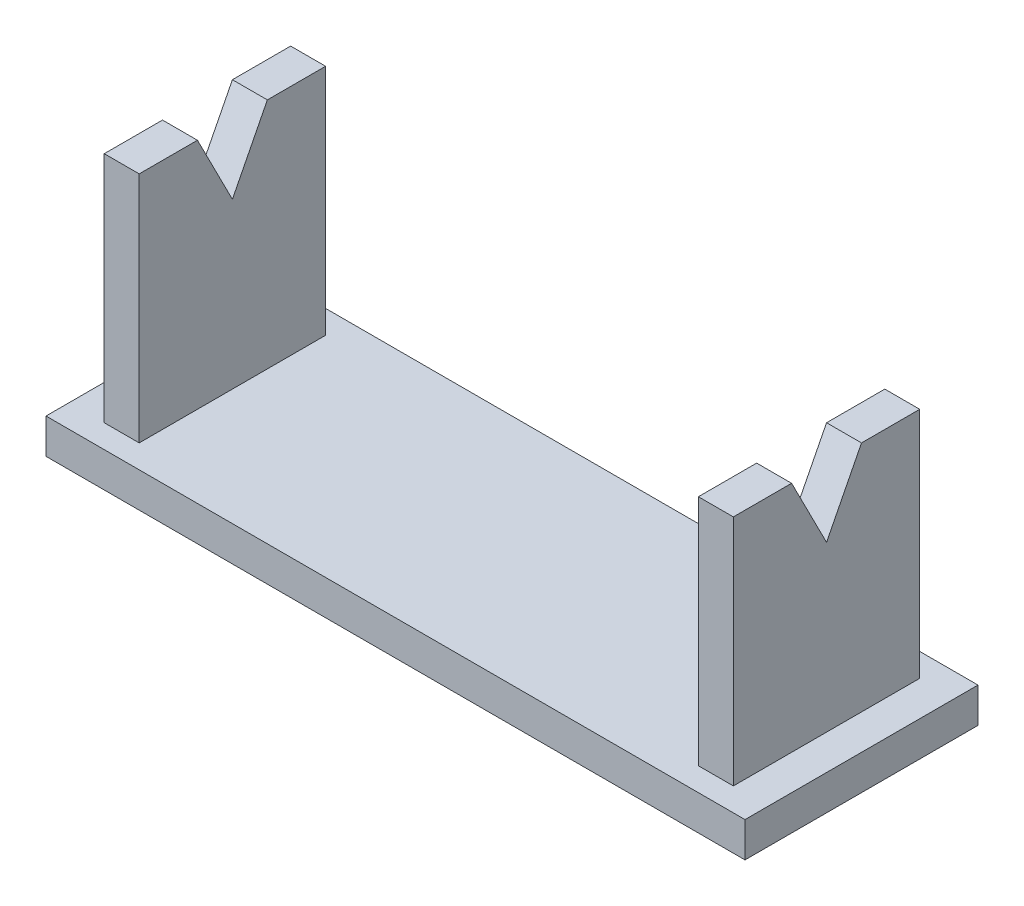
ISO-10303-21;
HEADER;
FILE_DESCRIPTION(('STEP AP214'),'2;1');
FILE_NAME('part.step','',(''),(''),'','','');
FILE_SCHEMA(('AUTOMOTIVE_DESIGN { 1 0 10303 214 1 1 1 1 }'));
ENDSEC;
DATA;
#1=APPLICATION_CONTEXT('core data for automotive mechanical design processes');
#2=APPLICATION_PROTOCOL_DEFINITION('international standard','automotive_design',2000,#1);
#3=PRODUCT_CONTEXT('',#1,'mechanical');
#4=PRODUCT('Part','Part','',(#3));
#5=PRODUCT_RELATED_PRODUCT_CATEGORY('part','',(#4));
#6=PRODUCT_DEFINITION_FORMATION('','',#4);
#7=PRODUCT_DEFINITION_CONTEXT('part definition',#1,'design');
#8=PRODUCT_DEFINITION('design','',#6,#7);
#9=PRODUCT_DEFINITION_SHAPE('','',#8);
#10=(LENGTH_UNIT() NAMED_UNIT(*) SI_UNIT(.MILLI.,.METRE.));
#11=(NAMED_UNIT(*) PLANE_ANGLE_UNIT() SI_UNIT($,.RADIAN.));
#12=(NAMED_UNIT(*) SI_UNIT($,.STERADIAN.) SOLID_ANGLE_UNIT());
#13=UNCERTAINTY_MEASURE_WITH_UNIT(LENGTH_MEASURE(1.E-05),#10,'distance_accuracy_value','');
#14=(GEOMETRIC_REPRESENTATION_CONTEXT(3) GLOBAL_UNCERTAINTY_ASSIGNED_CONTEXT((#13)) GLOBAL_UNIT_ASSIGNED_CONTEXT((#10,
#11,#12)) REPRESENTATION_CONTEXT('',''));
#15=CARTESIAN_POINT('',(0.,0.,0.));
#16=DIRECTION('',(0.,0.,1.));
#17=DIRECTION('',(1.,0.,0.));
#18=AXIS2_PLACEMENT_3D('',#15,#16,#17);
#19=CARTESIAN_POINT('',(0.,23.,0.));
#20=DIRECTION('',(0.,1.,0.));
#21=DIRECTION('',(0.,0.,1.));
#22=AXIS2_PLACEMENT_3D('',#19,#20,#21);
#23=PLANE('',#22);
#24=DIRECTION('',(1.,0.,0.));
#25=VECTOR('',#24,1.);
#26=CARTESIAN_POINT('',(0.,23.,-13.));
#27=LINE('',#26,#25);
#28=CARTESIAN_POINT('',(3.,23.,-13.));
#29=VERTEX_POINT('',#28);
#30=CARTESIAN_POINT('',(6.,23.,-13.));
#31=VERTEX_POINT('',#30);
#32=EDGE_CURVE('E171',#29,#31,#27,.T.);
#33=ORIENTED_EDGE('',*,*,#32,.T.);
#34=DIRECTION('',(0.,0.,-1.));
#35=VECTOR('',#34,1.);
#36=CARTESIAN_POINT('',(6.,23.,-18.));
#37=LINE('',#36,#35);
#38=CARTESIAN_POINT('',(6.,23.,-18.));
#39=VERTEX_POINT('',#38);
#40=EDGE_CURVE('E260',#31,#39,#37,.T.);
#41=ORIENTED_EDGE('',*,*,#40,.T.);
#42=DIRECTION('',(-1.,0.,0.));
#43=VECTOR('',#42,1.);
#44=CARTESIAN_POINT('',(3.,23.,-18.));
#45=LINE('',#44,#43);
#46=CARTESIAN_POINT('',(3.,23.,-18.));
#47=VERTEX_POINT('',#46);
#48=EDGE_CURVE('E265',#39,#47,#45,.T.);
#49=ORIENTED_EDGE('',*,*,#48,.T.);
#50=DIRECTION('',(0.,0.,1.));
#51=VECTOR('',#50,1.);
#52=CARTESIAN_POINT('',(3.,23.,-18.));
#53=LINE('',#52,#51);
#54=EDGE_CURVE('E254',#47,#29,#53,.T.);
#55=ORIENTED_EDGE('',*,*,#54,.T.);
#56=EDGE_LOOP('',(#33,#41,#49,#55));
#57=FACE_BOUND('',#56,.T.);
#58=ADVANCED_FACE('F39',(#57),#23,.T.);
#59=CARTESIAN_POINT('',(0.,23.,0.));
#60=DIRECTION('',(0.,1.,0.));
#61=DIRECTION('',(0.,0.,1.));
#62=AXIS2_PLACEMENT_3D('',#59,#60,#61);
#63=PLANE('',#62);
#64=DIRECTION('',(-1.,0.,0.));
#65=VECTOR('',#64,1.);
#66=CARTESIAN_POINT('',(0.,23.,-13.));
#67=LINE('',#66,#65);
#68=CARTESIAN_POINT('',(57.,23.,-13.));
#69=VERTEX_POINT('',#68);
#70=CARTESIAN_POINT('',(54.,23.,-13.));
#71=VERTEX_POINT('',#70);
#72=EDGE_CURVE('E11',#69,#71,#67,.T.);
#73=ORIENTED_EDGE('',*,*,#72,.F.);
#74=DIRECTION('',(0.,0.,-1.));
#75=VECTOR('',#74,1.);
#76=CARTESIAN_POINT('',(57.,23.,-18.));
#77=LINE('',#76,#75);
#78=CARTESIAN_POINT('',(57.,23.,-18.));
#79=VERTEX_POINT('',#78);
#80=EDGE_CURVE('E218',#69,#79,#77,.T.);
#81=ORIENTED_EDGE('',*,*,#80,.T.);
#82=DIRECTION('',(-1.,0.,0.));
#83=VECTOR('',#82,1.);
#84=CARTESIAN_POINT('',(57.,23.,-18.));
#85=LINE('',#84,#83);
#86=CARTESIAN_POINT('',(54.,23.,-18.));
#87=VERTEX_POINT('',#86);
#88=EDGE_CURVE('E205',#79,#87,#85,.T.);
#89=ORIENTED_EDGE('',*,*,#88,.T.);
#90=DIRECTION('',(0.,0.,1.));
#91=VECTOR('',#90,1.);
#92=CARTESIAN_POINT('',(54.,23.,-18.));
#93=LINE('',#92,#91);
#94=EDGE_CURVE('E211',#87,#71,#93,.T.);
#95=ORIENTED_EDGE('',*,*,#94,.T.);
#96=EDGE_LOOP('',(#73,#81,#89,#95));
#97=FACE_BOUND('',#96,.T.);
#98=ADVANCED_FACE('F367',(#97),#63,.T.);
#99=CARTESIAN_POINT('',(0.,3.,0.));
#100=DIRECTION('',(0.,-1.,0.));
#101=DIRECTION('',(0.,0.,-1.));
#102=AXIS2_PLACEMENT_3D('',#99,#100,#101);
#103=PLANE('',#102);
#104=DIRECTION('',(0.,0.,1.));
#105=VECTOR('',#104,1.);
#106=CARTESIAN_POINT('',(3.,3.,-18.));
#107=LINE('',#106,#105);
#108=CARTESIAN_POINT('',(3.,3.,-18.));
#109=VERTEX_POINT('',#108);
#110=CARTESIAN_POINT('',(3.,3.,-2.));
#111=VERTEX_POINT('',#110);
#112=EDGE_CURVE('E253',#109,#111,#107,.T.);
#113=ORIENTED_EDGE('',*,*,#112,.F.);
#114=DIRECTION('',(-1.,0.,0.));
#115=VECTOR('',#114,1.);
#116=CARTESIAN_POINT('',(3.,3.,-18.));
#117=LINE('',#116,#115);
#118=CARTESIAN_POINT('',(6.,3.,-18.));
#119=VERTEX_POINT('',#118);
#120=EDGE_CURVE('E280',#119,#109,#117,.T.);
#121=ORIENTED_EDGE('',*,*,#120,.F.);
#122=DIRECTION('',(0.,0.,-1.));
#123=VECTOR('',#122,1.);
#124=CARTESIAN_POINT('',(6.,3.,-18.));
#125=LINE('',#124,#123);
#126=CARTESIAN_POINT('',(6.,3.,-2.));
#127=VERTEX_POINT('',#126);
#128=EDGE_CURVE('E276',#127,#119,#125,.T.);
#129=ORIENTED_EDGE('',*,*,#128,.F.);
#130=DIRECTION('',(1.,0.,0.));
#131=VECTOR('',#130,1.);
#132=CARTESIAN_POINT('',(3.,3.,-2.));
#133=LINE('',#132,#131);
#134=EDGE_CURVE('E272',#111,#127,#133,.T.);
#135=ORIENTED_EDGE('',*,*,#134,.F.);
#136=EDGE_LOOP('',(#113,#121,#129,#135));
#137=FACE_BOUND('',#136,.T.);
#138=DIRECTION('',(0.,0.,1.));
#139=VECTOR('',#138,1.);
#140=CARTESIAN_POINT('',(0.,3.,0.));
#141=LINE('',#140,#139);
#142=CARTESIAN_POINT('',(0.,3.,-20.));
#143=VERTEX_POINT('',#142);
#144=CARTESIAN_POINT('',(0.,3.,0.));
#145=VERTEX_POINT('',#144);
#146=EDGE_CURVE('E300',#143,#145,#141,.T.);
#147=ORIENTED_EDGE('',*,*,#146,.T.);
#148=DIRECTION('',(1.,0.,0.));
#149=VECTOR('',#148,1.);
#150=CARTESIAN_POINT('',(0.,3.,0.));
#151=LINE('',#150,#149);
#152=CARTESIAN_POINT('',(60.,3.,0.));
#153=VERTEX_POINT('',#152);
#154=EDGE_CURVE('E304',#145,#153,#151,.T.);
#155=ORIENTED_EDGE('',*,*,#154,.T.);
#156=DIRECTION('',(0.,0.,-1.));
#157=VECTOR('',#156,1.);
#158=CARTESIAN_POINT('',(60.,3.,-20.));
#159=LINE('',#158,#157);
#160=CARTESIAN_POINT('',(60.,3.,-20.));
#161=VERTEX_POINT('',#160);
#162=EDGE_CURVE('E308',#153,#161,#159,.T.);
#163=ORIENTED_EDGE('',*,*,#162,.T.);
#164=DIRECTION('',(-1.,0.,0.));
#165=VECTOR('',#164,1.);
#166=CARTESIAN_POINT('',(0.,3.,-20.));
#167=LINE('',#166,#165);
#168=EDGE_CURVE('E311',#161,#143,#167,.T.);
#169=ORIENTED_EDGE('',*,*,#168,.T.);
#170=EDGE_LOOP('',(#147,#155,#163,#169));
#171=FACE_BOUND('',#170,.T.);
#172=DIRECTION('',(-1.,0.,0.));
#173=VECTOR('',#172,1.);
#174=CARTESIAN_POINT('',(57.,3.,-18.));
#175=LINE('',#174,#173);
#176=CARTESIAN_POINT('',(57.,3.,-18.));
#177=VERTEX_POINT('',#176);
#178=CARTESIAN_POINT('',(54.,3.,-18.));
#179=VERTEX_POINT('',#178);
#180=EDGE_CURVE('E176',#177,#179,#175,.T.);
#181=ORIENTED_EDGE('',*,*,#180,.F.);
#182=DIRECTION('',(0.,0.,-1.));
#183=VECTOR('',#182,1.);
#184=CARTESIAN_POINT('',(57.,3.,-18.));
#185=LINE('',#184,#183);
#186=CARTESIAN_POINT('',(57.,3.,-2.));
#187=VERTEX_POINT('',#186);
#188=EDGE_CURVE('E210',#187,#177,#185,.T.);
#189=ORIENTED_EDGE('',*,*,#188,.F.);
#190=DIRECTION('',(1.,0.,0.));
#191=VECTOR('',#190,1.);
#192=CARTESIAN_POINT('',(57.,3.,-2.));
#193=LINE('',#192,#191);
#194=CARTESIAN_POINT('',(54.,3.,-2.));
#195=VERTEX_POINT('',#194);
#196=EDGE_CURVE('E231',#195,#187,#193,.T.);
#197=ORIENTED_EDGE('',*,*,#196,.F.);
#198=DIRECTION('',(0.,0.,1.));
#199=VECTOR('',#198,1.);
#200=CARTESIAN_POINT('',(54.,3.,-18.));
#201=LINE('',#200,#199);
#202=EDGE_CURVE('E227',#179,#195,#201,.T.);
#203=ORIENTED_EDGE('',*,*,#202,.F.);
#204=EDGE_LOOP('',(#181,#189,#197,#203));
#205=FACE_BOUND('',#204,.T.);
#206=ADVANCED_FACE('F382',(#137,#171,#205),#103,.F.);
#207=CARTESIAN_POINT('',(0.,3.,0.));
#208=DIRECTION('',(1.,0.,0.));
#209=DIRECTION('',(0.,0.,-1.));
#210=AXIS2_PLACEMENT_3D('',#207,#208,#209);
#211=PLANE('',#210);
#212=DIRECTION('',(0.,0.,1.));
#213=VECTOR('',#212,1.);
#214=CARTESIAN_POINT('',(0.,0.,0.));
#215=LINE('',#214,#213);
#216=CARTESIAN_POINT('',(0.,0.,-20.));
#217=VERTEX_POINT('',#216);
#218=CARTESIAN_POINT('',(0.,0.,0.));
#219=VERTEX_POINT('',#218);
#220=EDGE_CURVE('E299',#217,#219,#215,.T.);
#221=ORIENTED_EDGE('',*,*,#220,.T.);
#222=DIRECTION('',(0.,-1.,0.));
#223=VECTOR('',#222,1.);
#224=CARTESIAN_POINT('',(0.,3.,0.));
#225=LINE('',#224,#223);
#226=EDGE_CURVE('E337',#145,#219,#225,.T.);
#227=ORIENTED_EDGE('',*,*,#226,.F.);
#228=ORIENTED_EDGE('',*,*,#146,.F.);
#229=DIRECTION('',(0.,-1.,0.));
#230=VECTOR('',#229,1.);
#231=CARTESIAN_POINT('',(0.,3.,-20.));
#232=LINE('',#231,#230);
#233=EDGE_CURVE('E314',#143,#217,#232,.T.);
#234=ORIENTED_EDGE('',*,*,#233,.T.);
#235=EDGE_LOOP('',(#221,#227,#228,#234));
#236=FACE_BOUND('',#235,.T.);
#237=ADVANCED_FACE('F41',(#236),#211,.F.);
#238=CARTESIAN_POINT('',(0.,3.,0.));
#239=DIRECTION('',(0.,0.,-1.));
#240=DIRECTION('',(-1.,0.,0.));
#241=AXIS2_PLACEMENT_3D('',#238,#239,#240);
#242=PLANE('',#241);
#243=DIRECTION('',(1.,0.,0.));
#244=VECTOR('',#243,1.);
#245=CARTESIAN_POINT('',(0.,0.,0.));
#246=LINE('',#245,#244);
#247=CARTESIAN_POINT('',(60.,0.,0.));
#248=VERTEX_POINT('',#247);
#249=EDGE_CURVE('E318',#219,#248,#246,.T.);
#250=ORIENTED_EDGE('',*,*,#249,.T.);
#251=DIRECTION('',(0.,-1.,0.));
#252=VECTOR('',#251,1.);
#253=CARTESIAN_POINT('',(60.,3.,0.));
#254=LINE('',#253,#252);
#255=EDGE_CURVE('E333',#153,#248,#254,.T.);
#256=ORIENTED_EDGE('',*,*,#255,.F.);
#257=ORIENTED_EDGE('',*,*,#154,.F.);
#258=ORIENTED_EDGE('',*,*,#226,.T.);
#259=EDGE_LOOP('',(#250,#256,#257,#258));
#260=FACE_BOUND('',#259,.T.);
#261=ADVANCED_FACE('F405',(#260),#242,.F.);
#262=CARTESIAN_POINT('',(60.,3.,-20.));
#263=DIRECTION('',(-1.,0.,0.));
#264=DIRECTION('',(0.,0.,1.));
#265=AXIS2_PLACEMENT_3D('',#262,#263,#264);
#266=PLANE('',#265);
#267=DIRECTION('',(0.,0.,-1.));
#268=VECTOR('',#267,1.);
#269=CARTESIAN_POINT('',(60.,0.,-20.));
#270=LINE('',#269,#268);
#271=CARTESIAN_POINT('',(60.,0.,-20.));
#272=VERTEX_POINT('',#271);
#273=EDGE_CURVE('E321',#248,#272,#270,.T.);
#274=ORIENTED_EDGE('',*,*,#273,.T.);
#275=DIRECTION('',(0.,-1.,0.));
#276=VECTOR('',#275,1.);
#277=CARTESIAN_POINT('',(60.,3.,-20.));
#278=LINE('',#277,#276);
#279=EDGE_CURVE('E329',#161,#272,#278,.T.);
#280=ORIENTED_EDGE('',*,*,#279,.F.);
#281=ORIENTED_EDGE('',*,*,#162,.F.);
#282=ORIENTED_EDGE('',*,*,#255,.T.);
#283=EDGE_LOOP('',(#274,#280,#281,#282));
#284=FACE_BOUND('',#283,.T.);
#285=ADVANCED_FACE('F437',(#284),#266,.F.);
#286=CARTESIAN_POINT('',(0.,3.,-20.));
#287=DIRECTION('',(0.,0.,1.));
#288=DIRECTION('',(1.,0.,0.));
#289=AXIS2_PLACEMENT_3D('',#286,#287,#288);
#290=PLANE('',#289);
#291=DIRECTION('',(-1.,0.,0.));
#292=VECTOR('',#291,1.);
#293=CARTESIAN_POINT('',(0.,0.,-20.));
#294=LINE('',#293,#292);
#295=EDGE_CURVE('E305',#272,#217,#294,.T.);
#296=ORIENTED_EDGE('',*,*,#295,.T.);
#297=ORIENTED_EDGE('',*,*,#233,.F.);
#298=ORIENTED_EDGE('',*,*,#168,.F.);
#299=ORIENTED_EDGE('',*,*,#279,.T.);
#300=EDGE_LOOP('',(#296,#297,#298,#299));
#301=FACE_BOUND('',#300,.T.);
#302=ADVANCED_FACE('F432',(#301),#290,.F.);
#303=CARTESIAN_POINT('',(0.,0.,0.));
#304=DIRECTION('',(0.,-1.,0.));
#305=DIRECTION('',(0.,0.,-1.));
#306=AXIS2_PLACEMENT_3D('',#303,#304,#305);
#307=PLANE('',#306);
#308=ORIENTED_EDGE('',*,*,#220,.F.);
#309=ORIENTED_EDGE('',*,*,#295,.F.);
#310=ORIENTED_EDGE('',*,*,#273,.F.);
#311=ORIENTED_EDGE('',*,*,#249,.F.);
#312=EDGE_LOOP('',(#308,#309,#310,#311));
#313=FACE_BOUND('',#312,.T.);
#314=ADVANCED_FACE('F428',(#313),#307,.T.);
#315=CARTESIAN_POINT('',(3.,23.,-18.));
#316=DIRECTION('',(1.,0.,0.));
#317=DIRECTION('',(0.,0.,-1.));
#318=AXIS2_PLACEMENT_3D('',#315,#316,#317);
#319=PLANE('',#318);
#320=DIRECTION('',(0.,-0.891069401417807,-0.453867075096786));
#321=VECTOR('',#320,1.);
#322=CARTESIAN_POINT('',(3.,18.5513023077728,-9.26594854042605));
#323=LINE('',#322,#321);
#324=CARTESIAN_POINT('',(3.,23.,-7.00000000000003));
#325=VERTEX_POINT('',#324);
#326=CARTESIAN_POINT('',(3.,17.110151736203,-10.));
#327=VERTEX_POINT('',#326);
#328=EDGE_CURVE('E55',#325,#327,#323,.T.);
#329=ORIENTED_EDGE('',*,*,#328,.T.);
#330=DIRECTION('',(0.,0.891069401417807,-0.453867075096786));
#331=VECTOR('',#330,1.);
#332=CARTESIAN_POINT('',(3.,25.0221353146487,-14.0299766092846));
#333=LINE('',#332,#331);
#334=EDGE_CURVE('E166',#327,#29,#333,.T.);
#335=ORIENTED_EDGE('',*,*,#334,.T.);
#336=ORIENTED_EDGE('',*,*,#54,.F.);
#337=DIRECTION('',(0.,-1.,0.));
#338=VECTOR('',#337,1.);
#339=CARTESIAN_POINT('',(3.,23.,-18.));
#340=LINE('',#339,#338);
#341=EDGE_CURVE('E268',#47,#109,#340,.T.);
#342=ORIENTED_EDGE('',*,*,#341,.T.);
#343=ORIENTED_EDGE('',*,*,#112,.T.);
#344=DIRECTION('',(0.,-1.,0.));
#345=VECTOR('',#344,1.);
#346=CARTESIAN_POINT('',(3.,23.,-2.));
#347=LINE('',#346,#345);
#348=CARTESIAN_POINT('',(3.,23.,-2.));
#349=VERTEX_POINT('',#348);
#350=EDGE_CURVE('E295',#349,#111,#347,.T.);
#351=ORIENTED_EDGE('',*,*,#350,.F.);
#352=EDGE_CURVE('E188',#325,#349,#53,.T.);
#353=ORIENTED_EDGE('',*,*,#352,.F.);
#354=EDGE_LOOP('',(#329,#335,#336,#342,#343,#351,#353));
#355=FACE_BOUND('',#354,.T.);
#356=ADVANCED_FACE('F186',(#355),#319,.F.);
#357=CARTESIAN_POINT('',(3.,23.,-2.));
#358=DIRECTION('',(0.,0.,-1.));
#359=DIRECTION('',(-1.,0.,0.));
#360=AXIS2_PLACEMENT_3D('',#357,#358,#359);
#361=PLANE('',#360);
#362=ORIENTED_EDGE('',*,*,#134,.T.);
#363=DIRECTION('',(0.,-1.,0.));
#364=VECTOR('',#363,1.);
#365=CARTESIAN_POINT('',(6.,23.,-2.));
#366=LINE('',#365,#364);
#367=CARTESIAN_POINT('',(6.,23.,-2.));
#368=VERTEX_POINT('',#367);
#369=EDGE_CURVE('E291',#368,#127,#366,.T.);
#370=ORIENTED_EDGE('',*,*,#369,.F.);
#371=DIRECTION('',(1.,0.,0.));
#372=VECTOR('',#371,1.);
#373=CARTESIAN_POINT('',(3.,23.,-2.));
#374=LINE('',#373,#372);
#375=EDGE_CURVE('E257',#349,#368,#374,.T.);
#376=ORIENTED_EDGE('',*,*,#375,.F.);
#377=ORIENTED_EDGE('',*,*,#350,.T.);
#378=EDGE_LOOP('',(#362,#370,#376,#377));
#379=FACE_BOUND('',#378,.T.);
#380=ADVANCED_FACE('F387',(#379),#361,.F.);
#381=CARTESIAN_POINT('',(6.,23.,-18.));
#382=DIRECTION('',(-1.,0.,0.));
#383=DIRECTION('',(0.,0.,1.));
#384=AXIS2_PLACEMENT_3D('',#381,#382,#383);
#385=PLANE('',#384);
#386=ORIENTED_EDGE('',*,*,#40,.F.);
#387=DIRECTION('',(0.,-0.891069401417807,0.453867075096786));
#388=VECTOR('',#387,1.);
#389=CARTESIAN_POINT('',(6.,25.0221353146487,-14.0299766092846));
#390=LINE('',#389,#388);
#391=CARTESIAN_POINT('',(6.,17.110151736203,-10.));
#392=VERTEX_POINT('',#391);
#393=EDGE_CURVE('E177',#31,#392,#390,.T.);
#394=ORIENTED_EDGE('',*,*,#393,.T.);
#395=DIRECTION('',(0.,0.891069401417807,0.453867075096786));
#396=VECTOR('',#395,1.);
#397=CARTESIAN_POINT('',(6.,18.5513023077728,-9.26594854042605));
#398=LINE('',#397,#396);
#399=CARTESIAN_POINT('',(6.,23.,-7.00000000000002));
#400=VERTEX_POINT('',#399);
#401=EDGE_CURVE('E181',#392,#400,#398,.T.);
#402=ORIENTED_EDGE('',*,*,#401,.T.);
#403=EDGE_CURVE('E261',#368,#400,#37,.T.);
#404=ORIENTED_EDGE('',*,*,#403,.F.);
#405=ORIENTED_EDGE('',*,*,#369,.T.);
#406=ORIENTED_EDGE('',*,*,#128,.T.);
#407=DIRECTION('',(0.,-1.,0.));
#408=VECTOR('',#407,1.);
#409=CARTESIAN_POINT('',(6.,23.,-18.));
#410=LINE('',#409,#408);
#411=EDGE_CURVE('E287',#39,#119,#410,.T.);
#412=ORIENTED_EDGE('',*,*,#411,.F.);
#413=EDGE_LOOP('',(#386,#394,#402,#404,#405,#406,#412));
#414=FACE_BOUND('',#413,.T.);
#415=ADVANCED_FACE('F378',(#414),#385,.F.);
#416=CARTESIAN_POINT('',(3.,23.,-18.));
#417=DIRECTION('',(0.,0.,1.));
#418=DIRECTION('',(1.,0.,0.));
#419=AXIS2_PLACEMENT_3D('',#416,#417,#418);
#420=PLANE('',#419);
#421=ORIENTED_EDGE('',*,*,#120,.T.);
#422=ORIENTED_EDGE('',*,*,#341,.F.);
#423=ORIENTED_EDGE('',*,*,#48,.F.);
#424=ORIENTED_EDGE('',*,*,#411,.T.);
#425=EDGE_LOOP('',(#421,#422,#423,#424));
#426=FACE_BOUND('',#425,.T.);
#427=ADVANCED_FACE('F380',(#426),#420,.F.);
#428=DIRECTION('',(1.,0.,0.));
#429=VECTOR('',#428,1.);
#430=CARTESIAN_POINT('',(0.,23.,-7.00000000000003));
#431=LINE('',#430,#429);
#432=EDGE_CURVE('E391',#325,#400,#431,.T.);
#433=ORIENTED_EDGE('',*,*,#432,.F.);
#434=ORIENTED_EDGE('',*,*,#352,.T.);
#435=ORIENTED_EDGE('',*,*,#375,.T.);
#436=ORIENTED_EDGE('',*,*,#403,.T.);
#437=EDGE_LOOP('',(#433,#434,#435,#436));
#438=FACE_BOUND('',#437,.T.);
#439=ADVANCED_FACE('F390',(#438),#23,.T.);
#440=CARTESIAN_POINT('',(57.,23.,-18.));
#441=DIRECTION('',(0.,0.,1.));
#442=DIRECTION('',(1.,0.,0.));
#443=AXIS2_PLACEMENT_3D('',#440,#441,#442);
#444=PLANE('',#443);
#445=ORIENTED_EDGE('',*,*,#180,.T.);
#446=DIRECTION('',(0.,-1.,0.));
#447=VECTOR('',#446,1.);
#448=CARTESIAN_POINT('',(54.,23.,-18.));
#449=LINE('',#448,#447);
#450=EDGE_CURVE('E249',#87,#179,#449,.T.);
#451=ORIENTED_EDGE('',*,*,#450,.F.);
#452=ORIENTED_EDGE('',*,*,#88,.F.);
#453=DIRECTION('',(0.,-1.,0.));
#454=VECTOR('',#453,1.);
#455=CARTESIAN_POINT('',(57.,23.,-18.));
#456=LINE('',#455,#454);
#457=EDGE_CURVE('E223',#79,#177,#456,.T.);
#458=ORIENTED_EDGE('',*,*,#457,.T.);
#459=EDGE_LOOP('',(#445,#451,#452,#458));
#460=FACE_BOUND('',#459,.T.);
#461=ADVANCED_FACE('F363',(#460),#444,.F.);
#462=CARTESIAN_POINT('',(54.,23.,-18.));
#463=DIRECTION('',(1.,0.,0.));
#464=DIRECTION('',(0.,0.,-1.));
#465=AXIS2_PLACEMENT_3D('',#462,#463,#464);
#466=PLANE('',#465);
#467=DIRECTION('',(0.,-0.891069401417807,-0.453867075096786));
#468=VECTOR('',#467,1.);
#469=CARTESIAN_POINT('',(54.,18.5513023077728,-9.26594854042603));
#470=LINE('',#469,#468);
#471=CARTESIAN_POINT('',(54.,23.,-7.));
#472=VERTEX_POINT('',#471);
#473=CARTESIAN_POINT('',(54.,17.110151736203,-10.));
#474=VERTEX_POINT('',#473);
#475=EDGE_CURVE('E63',#472,#474,#470,.T.);
#476=ORIENTED_EDGE('',*,*,#475,.T.);
#477=DIRECTION('',(0.,0.891069401417807,-0.453867075096786));
#478=VECTOR('',#477,1.);
#479=CARTESIAN_POINT('',(54.,25.0221353146487,-14.0299766092846));
#480=LINE('',#479,#478);
#481=EDGE_CURVE('E195',#474,#71,#480,.T.);
#482=ORIENTED_EDGE('',*,*,#481,.T.);
#483=ORIENTED_EDGE('',*,*,#94,.F.);
#484=ORIENTED_EDGE('',*,*,#450,.T.);
#485=ORIENTED_EDGE('',*,*,#202,.T.);
#486=DIRECTION('',(0.,-1.,0.));
#487=VECTOR('',#486,1.);
#488=CARTESIAN_POINT('',(54.,23.,-2.));
#489=LINE('',#488,#487);
#490=CARTESIAN_POINT('',(54.,23.,-2.));
#491=VERTEX_POINT('',#490);
#492=EDGE_CURVE('E245',#491,#195,#489,.T.);
#493=ORIENTED_EDGE('',*,*,#492,.F.);
#494=EDGE_CURVE('E209',#472,#491,#93,.T.);
#495=ORIENTED_EDGE('',*,*,#494,.F.);
#496=EDGE_LOOP('',(#476,#482,#483,#484,#485,#493,#495));
#497=FACE_BOUND('',#496,.T.);
#498=ADVANCED_FACE('F398',(#497),#466,.F.);
#499=CARTESIAN_POINT('',(57.,23.,-2.));
#500=DIRECTION('',(0.,0.,-1.));
#501=DIRECTION('',(-1.,0.,0.));
#502=AXIS2_PLACEMENT_3D('',#499,#500,#501);
#503=PLANE('',#502);
#504=ORIENTED_EDGE('',*,*,#196,.T.);
#505=DIRECTION('',(0.,-1.,0.));
#506=VECTOR('',#505,1.);
#507=CARTESIAN_POINT('',(57.,23.,-2.));
#508=LINE('',#507,#506);
#509=CARTESIAN_POINT('',(57.,23.,-2.));
#510=VERTEX_POINT('',#509);
#511=EDGE_CURVE('E241',#510,#187,#508,.T.);
#512=ORIENTED_EDGE('',*,*,#511,.F.);
#513=DIRECTION('',(1.,0.,0.));
#514=VECTOR('',#513,1.);
#515=CARTESIAN_POINT('',(57.,23.,-2.));
#516=LINE('',#515,#514);
#517=EDGE_CURVE('E215',#491,#510,#516,.T.);
#518=ORIENTED_EDGE('',*,*,#517,.F.);
#519=ORIENTED_EDGE('',*,*,#492,.T.);
#520=EDGE_LOOP('',(#504,#512,#518,#519));
#521=FACE_BOUND('',#520,.T.);
#522=ADVANCED_FACE('F358',(#521),#503,.F.);
#523=CARTESIAN_POINT('',(57.,23.,-18.));
#524=DIRECTION('',(-1.,0.,0.));
#525=DIRECTION('',(0.,0.,1.));
#526=AXIS2_PLACEMENT_3D('',#523,#524,#525);
#527=PLANE('',#526);
#528=ORIENTED_EDGE('',*,*,#80,.F.);
#529=DIRECTION('',(0.,-0.891069401417807,0.453867075096786));
#530=VECTOR('',#529,1.);
#531=CARTESIAN_POINT('',(57.,25.0221353146487,-14.0299766092846));
#532=LINE('',#531,#530);
#533=CARTESIAN_POINT('',(57.,17.110151736203,-10.));
#534=VERTEX_POINT('',#533);
#535=EDGE_CURVE('E190',#69,#534,#532,.T.);
#536=ORIENTED_EDGE('',*,*,#535,.T.);
#537=DIRECTION('',(0.,0.891069401417807,0.453867075096786));
#538=VECTOR('',#537,1.);
#539=CARTESIAN_POINT('',(57.,18.5513023077728,-9.26594854042603));
#540=LINE('',#539,#538);
#541=CARTESIAN_POINT('',(57.,23.,-7.));
#542=VERTEX_POINT('',#541);
#543=EDGE_CURVE('E343',#534,#542,#540,.T.);
#544=ORIENTED_EDGE('',*,*,#543,.T.);
#545=EDGE_CURVE('E219',#510,#542,#77,.T.);
#546=ORIENTED_EDGE('',*,*,#545,.F.);
#547=ORIENTED_EDGE('',*,*,#511,.T.);
#548=ORIENTED_EDGE('',*,*,#188,.T.);
#549=ORIENTED_EDGE('',*,*,#457,.F.);
#550=EDGE_LOOP('',(#528,#536,#544,#546,#547,#548,#549));
#551=FACE_BOUND('',#550,.T.);
#552=ADVANCED_FACE('F350',(#551),#527,.F.);
#553=DIRECTION('',(1.,0.,0.));
#554=VECTOR('',#553,1.);
#555=CARTESIAN_POINT('',(0.,23.,-7.00000000000003));
#556=LINE('',#555,#554);
#557=EDGE_CURVE('E48',#472,#542,#556,.T.);
#558=ORIENTED_EDGE('',*,*,#557,.F.);
#559=ORIENTED_EDGE('',*,*,#494,.T.);
#560=ORIENTED_EDGE('',*,*,#517,.T.);
#561=ORIENTED_EDGE('',*,*,#545,.T.);
#562=EDGE_LOOP('',(#558,#559,#560,#561));
#563=FACE_BOUND('',#562,.T.);
#564=ADVANCED_FACE('F353',(#563),#63,.T.);
#565=CARTESIAN_POINT('',(0.,23.,-7.00000000000003));
#566=DIRECTION('',(0.,-0.453867075096786,0.891069401417807));
#567=DIRECTION('',(0.,-0.891069401417807,-0.453867075096786));
#568=AXIS2_PLACEMENT_3D('',#565,#566,#567);
#569=PLANE('',#568);
#570=ORIENTED_EDGE('',*,*,#557,.T.);
#571=ORIENTED_EDGE('',*,*,#543,.F.);
#572=DIRECTION('',(1.,0.,0.));
#573=VECTOR('',#572,1.);
#574=CARTESIAN_POINT('',(0.,17.110151736203,-10.));
#575=LINE('',#574,#573);
#576=EDGE_CURVE('E183',#474,#534,#575,.T.);
#577=ORIENTED_EDGE('',*,*,#576,.F.);
#578=ORIENTED_EDGE('',*,*,#475,.F.);
#579=EDGE_LOOP('',(#570,#571,#577,#578));
#580=FACE_BOUND('',#579,.T.);
#581=ADVANCED_FACE('F342',(#580),#569,.F.);
#582=CARTESIAN_POINT('',(0.,17.110151736203,-10.));
#583=DIRECTION('',(0.,-0.453867075096786,-0.891069401417807));
#584=DIRECTION('',(0.,0.891069401417807,-0.453867075096786));
#585=AXIS2_PLACEMENT_3D('',#582,#583,#584);
#586=PLANE('',#585);
#587=ORIENTED_EDGE('',*,*,#576,.T.);
#588=ORIENTED_EDGE('',*,*,#535,.F.);
#589=ORIENTED_EDGE('',*,*,#72,.T.);
#590=ORIENTED_EDGE('',*,*,#481,.F.);
#591=EDGE_LOOP('',(#587,#588,#589,#590));
#592=FACE_BOUND('',#591,.T.);
#593=ADVANCED_FACE('F555',(#592),#586,.F.);
#594=EDGE_CURVE('E168',#327,#392,#575,.T.);
#595=ORIENTED_EDGE('',*,*,#594,.T.);
#596=ORIENTED_EDGE('',*,*,#393,.F.);
#597=ORIENTED_EDGE('',*,*,#32,.F.);
#598=ORIENTED_EDGE('',*,*,#334,.F.);
#599=EDGE_LOOP('',(#595,#596,#597,#598));
#600=FACE_BOUND('',#599,.T.);
#601=ADVANCED_FACE('F167',(#600),#586,.F.);
#602=ORIENTED_EDGE('',*,*,#432,.T.);
#603=ORIENTED_EDGE('',*,*,#401,.F.);
#604=ORIENTED_EDGE('',*,*,#594,.F.);
#605=ORIENTED_EDGE('',*,*,#328,.F.);
#606=EDGE_LOOP('',(#602,#603,#604,#605));
#607=FACE_BOUND('',#606,.T.);
#608=ADVANCED_FACE('F179',(#607),#569,.F.);
#609=CLOSED_SHELL('',(#58,#98,#206,#237,#261,#285,#302,#314,#356,#380,#415,#427,#439,#461,#498,
#522,#552,#564,#581,#593,#601,#608));
#610=MANIFOLD_SOLID_BREP('B2',#609);
#611=ADVANCED_BREP_SHAPE_REPRESENTATION('',(#18,#610),#14);
#612=SHAPE_DEFINITION_REPRESENTATION(#9,#611);
ENDSEC;
END-ISO-10303-21;
